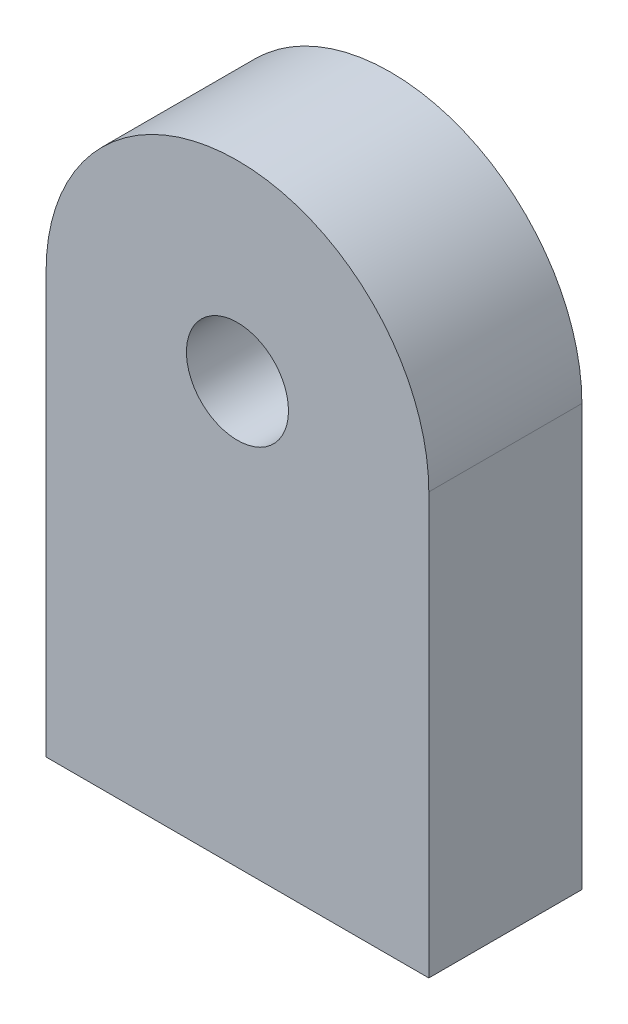
ISO-10303-21;
HEADER;
FILE_DESCRIPTION(('STEP AP214'),'2;1');
FILE_NAME('part.step','',(''),(''),'','','');
FILE_SCHEMA(('AUTOMOTIVE_DESIGN { 1 0 10303 214 1 1 1 1 }'));
ENDSEC;
DATA;
#1=APPLICATION_CONTEXT('core data for automotive mechanical design processes');
#2=APPLICATION_PROTOCOL_DEFINITION('international standard','automotive_design',2000,#1);
#3=PRODUCT_CONTEXT('',#1,'mechanical');
#4=PRODUCT('Part','Part','',(#3));
#5=PRODUCT_RELATED_PRODUCT_CATEGORY('part','',(#4));
#6=PRODUCT_DEFINITION_FORMATION('','',#4);
#7=PRODUCT_DEFINITION_CONTEXT('part definition',#1,'design');
#8=PRODUCT_DEFINITION('design','',#6,#7);
#9=PRODUCT_DEFINITION_SHAPE('','',#8);
#10=(LENGTH_UNIT() NAMED_UNIT(*) SI_UNIT(.MILLI.,.METRE.));
#11=(NAMED_UNIT(*) PLANE_ANGLE_UNIT() SI_UNIT($,.RADIAN.));
#12=(NAMED_UNIT(*) SI_UNIT($,.STERADIAN.) SOLID_ANGLE_UNIT());
#13=UNCERTAINTY_MEASURE_WITH_UNIT(LENGTH_MEASURE(1.E-05),#10,'distance_accuracy_value','');
#14=(GEOMETRIC_REPRESENTATION_CONTEXT(3) GLOBAL_UNCERTAINTY_ASSIGNED_CONTEXT((#13)) GLOBAL_UNIT_ASSIGNED_CONTEXT((#10,
#11,#12)) REPRESENTATION_CONTEXT('',''));
#15=CARTESIAN_POINT('',(0.,0.,0.));
#16=DIRECTION('',(0.,0.,1.));
#17=DIRECTION('',(1.,0.,0.));
#18=AXIS2_PLACEMENT_3D('',#15,#16,#17);
#19=CARTESIAN_POINT('',(0.,0.,0.));
#20=DIRECTION('',(0.,0.,1.));
#21=DIRECTION('',(1.,0.,0.));
#22=AXIS2_PLACEMENT_3D('',#19,#20,#21);
#23=PLANE('',#22);
#24=CARTESIAN_POINT('',(0.,0.,0.));
#25=DIRECTION('',(0.,0.,1.));
#26=DIRECTION('',(1.,0.,0.));
#27=AXIS2_PLACEMENT_3D('',#24,#25,#26);
#28=CIRCLE('',#27,15.);
#29=CARTESIAN_POINT('',(15.,0.,0.));
#30=VERTEX_POINT('',#29);
#31=CARTESIAN_POINT('',(-15.,0.,0.));
#32=VERTEX_POINT('',#31);
#33=EDGE_CURVE('E11',#30,#32,#28,.T.);
#34=ORIENTED_EDGE('',*,*,#33,.F.);
#35=DIRECTION('',(0.,1.,0.));
#36=VECTOR('',#35,1.);
#37=CARTESIAN_POINT('',(15.,0.,0.));
#38=LINE('',#37,#36);
#39=CARTESIAN_POINT('',(15.,-33.,0.));
#40=VERTEX_POINT('',#39);
#41=EDGE_CURVE('E65',#40,#30,#38,.T.);
#42=ORIENTED_EDGE('',*,*,#41,.F.);
#43=DIRECTION('',(1.,0.,0.));
#44=VECTOR('',#43,1.);
#45=CARTESIAN_POINT('',(15.,-33.,0.));
#46=LINE('',#45,#44);
#47=CARTESIAN_POINT('',(-15.,-33.,0.));
#48=VERTEX_POINT('',#47);
#49=EDGE_CURVE('E94',#48,#40,#46,.T.);
#50=ORIENTED_EDGE('',*,*,#49,.F.);
#51=DIRECTION('',(0.,-1.,0.));
#52=VECTOR('',#51,1.);
#53=CARTESIAN_POINT('',(-15.,0.,0.));
#54=LINE('',#53,#52);
#55=EDGE_CURVE('E102',#32,#48,#54,.T.);
#56=ORIENTED_EDGE('',*,*,#55,.F.);
#57=EDGE_LOOP('',(#34,#42,#50,#56));
#58=FACE_BOUND('',#57,.T.);
#59=CARTESIAN_POINT('',(0.,0.,0.));
#60=DIRECTION('',(0.,0.,1.));
#61=DIRECTION('',(1.,0.,0.));
#62=AXIS2_PLACEMENT_3D('',#59,#60,#61);
#63=CIRCLE('',#62,11.);
#64=CARTESIAN_POINT('',(11.,0.,0.));
#65=VERTEX_POINT('',#64);
#66=EDGE_CURVE('E50',#65,#65,#63,.T.);
#67=ORIENTED_EDGE('',*,*,#66,.T.);
#68=EDGE_LOOP('',(#67));
#69=FACE_BOUND('',#68,.T.);
#70=ADVANCED_FACE('F41',(#58,#69),#23,.F.);
#71=CARTESIAN_POINT('',(0.,0.,4.));
#72=DIRECTION('',(0.,0.,-1.));
#73=DIRECTION('',(-1.,0.,0.));
#74=AXIS2_PLACEMENT_3D('',#71,#72,#73);
#75=CYLINDRICAL_SURFACE('',#74,15.);
#76=CARTESIAN_POINT('',(0.,0.,12.));
#77=DIRECTION('',(0.,0.,1.));
#78=DIRECTION('',(1.,0.,0.));
#79=AXIS2_PLACEMENT_3D('',#76,#77,#78);
#80=CIRCLE('',#79,15.);
#81=CARTESIAN_POINT('',(15.,0.,12.));
#82=VERTEX_POINT('',#81);
#83=CARTESIAN_POINT('',(-15.,0.,12.));
#84=VERTEX_POINT('',#83);
#85=EDGE_CURVE('E134',#82,#84,#80,.T.);
#86=ORIENTED_EDGE('',*,*,#85,.F.);
#87=DIRECTION('',(0.,0.,1.));
#88=VECTOR('',#87,1.);
#89=CARTESIAN_POINT('',(15.,0.,0.));
#90=LINE('',#89,#88);
#91=EDGE_CURVE('E122',#30,#82,#90,.T.);
#92=ORIENTED_EDGE('',*,*,#91,.F.);
#93=ORIENTED_EDGE('',*,*,#33,.T.);
#94=DIRECTION('',(0.,0.,1.));
#95=VECTOR('',#94,1.);
#96=CARTESIAN_POINT('',(-15.,0.,0.));
#97=LINE('',#96,#95);
#98=EDGE_CURVE('E88',#32,#84,#97,.T.);
#99=ORIENTED_EDGE('',*,*,#98,.T.);
#100=EDGE_LOOP('',(#86,#92,#93,#99));
#101=FACE_BOUND('',#100,.T.);
#102=ADVANCED_FACE('F43',(#101),#75,.T.);
#103=CARTESIAN_POINT('',(0.,0.,4.));
#104=DIRECTION('',(0.,0.,-1.));
#105=DIRECTION('',(-1.,0.,0.));
#106=AXIS2_PLACEMENT_3D('',#103,#104,#105);
#107=CYLINDRICAL_SURFACE('',#106,11.);
#108=CARTESIAN_POINT('',(0.,0.,4.));
#109=DIRECTION('',(0.,0.,1.));
#110=DIRECTION('',(1.,0.,0.));
#111=AXIS2_PLACEMENT_3D('',#108,#109,#110);
#112=CIRCLE('',#111,11.);
#113=CARTESIAN_POINT('',(11.,0.,4.));
#114=VERTEX_POINT('',#113);
#115=EDGE_CURVE('E140',#114,#114,#112,.T.);
#116=ORIENTED_EDGE('',*,*,#115,.T.);
#117=EDGE_LOOP('',(#116));
#118=FACE_BOUND('',#117,.T.);
#119=ORIENTED_EDGE('',*,*,#66,.F.);
#120=EDGE_LOOP('',(#119));
#121=FACE_BOUND('',#120,.T.);
#122=ADVANCED_FACE('F147',(#118,#121),#107,.F.);
#123=CARTESIAN_POINT('',(0.,0.,4.));
#124=DIRECTION('',(0.,0.,1.));
#125=DIRECTION('',(1.,0.,0.));
#126=AXIS2_PLACEMENT_3D('',#123,#124,#125);
#127=PLANE('',#126);
#128=CARTESIAN_POINT('',(0.,0.,4.));
#129=DIRECTION('',(0.,0.,1.));
#130=DIRECTION('',(1.,0.,0.));
#131=AXIS2_PLACEMENT_3D('',#128,#129,#130);
#132=CIRCLE('',#131,4.);
#133=CARTESIAN_POINT('',(4.,0.,4.));
#134=VERTEX_POINT('',#133);
#135=EDGE_CURVE('E125',#134,#134,#132,.T.);
#136=ORIENTED_EDGE('',*,*,#135,.T.);
#137=EDGE_LOOP('',(#136));
#138=FACE_BOUND('',#137,.T.);
#139=ORIENTED_EDGE('',*,*,#115,.F.);
#140=EDGE_LOOP('',(#139));
#141=FACE_BOUND('',#140,.T.);
#142=ADVANCED_FACE('F149',(#138,#141),#127,.F.);
#143=CARTESIAN_POINT('',(0.,0.,12.));
#144=DIRECTION('',(0.,0.,1.));
#145=DIRECTION('',(1.,0.,0.));
#146=AXIS2_PLACEMENT_3D('',#143,#144,#145);
#147=PLANE('',#146);
#148=ORIENTED_EDGE('',*,*,#85,.T.);
#149=DIRECTION('',(0.,-1.,0.));
#150=VECTOR('',#149,1.);
#151=CARTESIAN_POINT('',(-15.,0.,12.));
#152=LINE('',#151,#150);
#153=CARTESIAN_POINT('',(-15.,-33.,12.));
#154=VERTEX_POINT('',#153);
#155=EDGE_CURVE('E116',#84,#154,#152,.T.);
#156=ORIENTED_EDGE('',*,*,#155,.T.);
#157=DIRECTION('',(1.,0.,0.));
#158=VECTOR('',#157,1.);
#159=CARTESIAN_POINT('',(15.,-33.,12.));
#160=LINE('',#159,#158);
#161=CARTESIAN_POINT('',(15.,-33.,12.));
#162=VERTEX_POINT('',#161);
#163=EDGE_CURVE('E95',#154,#162,#160,.T.);
#164=ORIENTED_EDGE('',*,*,#163,.T.);
#165=DIRECTION('',(0.,1.,0.));
#166=VECTOR('',#165,1.);
#167=CARTESIAN_POINT('',(15.,0.,12.));
#168=LINE('',#167,#166);
#169=EDGE_CURVE('E57',#162,#82,#168,.T.);
#170=ORIENTED_EDGE('',*,*,#169,.T.);
#171=EDGE_LOOP('',(#148,#156,#164,#170));
#172=FACE_BOUND('',#171,.T.);
#173=CARTESIAN_POINT('',(0.,0.,12.));
#174=DIRECTION('',(0.,0.,1.));
#175=DIRECTION('',(1.,0.,0.));
#176=AXIS2_PLACEMENT_3D('',#173,#174,#175);
#177=CIRCLE('',#176,4.);
#178=CARTESIAN_POINT('',(4.,0.,12.));
#179=VERTEX_POINT('',#178);
#180=EDGE_CURVE('E130',#179,#179,#177,.T.);
#181=ORIENTED_EDGE('',*,*,#180,.F.);
#182=EDGE_LOOP('',(#181));
#183=FACE_BOUND('',#182,.T.);
#184=ADVANCED_FACE('F156',(#172,#183),#147,.T.);
#185=CARTESIAN_POINT('',(0.,0.,12.));
#186=DIRECTION('',(0.,0.,-1.));
#187=DIRECTION('',(-1.,0.,0.));
#188=AXIS2_PLACEMENT_3D('',#185,#186,#187);
#189=CYLINDRICAL_SURFACE('',#188,4.);
#190=ORIENTED_EDGE('',*,*,#180,.T.);
#191=EDGE_LOOP('',(#190));
#192=FACE_BOUND('',#191,.T.);
#193=ORIENTED_EDGE('',*,*,#135,.F.);
#194=EDGE_LOOP('',(#193));
#195=FACE_BOUND('',#194,.T.);
#196=ADVANCED_FACE('F180',(#192,#195),#189,.F.);
#197=CARTESIAN_POINT('',(15.,0.,0.));
#198=DIRECTION('',(1.,0.,0.));
#199=DIRECTION('',(0.,1.,0.));
#200=AXIS2_PLACEMENT_3D('',#197,#198,#199);
#201=PLANE('',#200);
#202=ORIENTED_EDGE('',*,*,#169,.F.);
#203=DIRECTION('',(0.,0.,1.));
#204=VECTOR('',#203,1.);
#205=CARTESIAN_POINT('',(15.,-33.,0.));
#206=LINE('',#205,#204);
#207=EDGE_CURVE('E82',#40,#162,#206,.T.);
#208=ORIENTED_EDGE('',*,*,#207,.F.);
#209=ORIENTED_EDGE('',*,*,#41,.T.);
#210=ORIENTED_EDGE('',*,*,#91,.T.);
#211=EDGE_LOOP('',(#202,#208,#209,#210));
#212=FACE_BOUND('',#211,.T.);
#213=ADVANCED_FACE('F188',(#212),#201,.T.);
#214=CARTESIAN_POINT('',(15.,-33.,0.));
#215=DIRECTION('',(0.,-1.,0.));
#216=DIRECTION('',(1.,0.,0.));
#217=AXIS2_PLACEMENT_3D('',#214,#215,#216);
#218=PLANE('',#217);
#219=CARTESIAN_POINT('',(7.,-33.,6.));
#220=DIRECTION('',(0.,-1.,0.));
#221=DIRECTION('',(1.,0.,0.));
#222=AXIS2_PLACEMENT_3D('',#219,#220,#221);
#223=CIRCLE('',#222,3.);
#224=CARTESIAN_POINT('',(10.,-33.,6.));
#225=VERTEX_POINT('',#224);
#226=EDGE_CURVE('E285',#225,#225,#223,.T.);
#227=ORIENTED_EDGE('',*,*,#226,.F.);
#228=EDGE_LOOP('',(#227));
#229=FACE_BOUND('',#228,.T.);
#230=CARTESIAN_POINT('',(-6.99999999999999,-33.,6.));
#231=DIRECTION('',(0.,-1.,0.));
#232=DIRECTION('',(1.,0.,0.));
#233=AXIS2_PLACEMENT_3D('',#230,#231,#232);
#234=CIRCLE('',#233,3.);
#235=CARTESIAN_POINT('',(-3.99999999999999,-33.,6.));
#236=VERTEX_POINT('',#235);
#237=EDGE_CURVE('E111',#236,#236,#234,.T.);
#238=ORIENTED_EDGE('',*,*,#237,.F.);
#239=EDGE_LOOP('',(#238));
#240=FACE_BOUND('',#239,.T.);
#241=ORIENTED_EDGE('',*,*,#163,.F.);
#242=DIRECTION('',(0.,0.,1.));
#243=VECTOR('',#242,1.);
#244=CARTESIAN_POINT('',(-15.,-33.,0.));
#245=LINE('',#244,#243);
#246=EDGE_CURVE('E91',#48,#154,#245,.T.);
#247=ORIENTED_EDGE('',*,*,#246,.F.);
#248=ORIENTED_EDGE('',*,*,#49,.T.);
#249=ORIENTED_EDGE('',*,*,#207,.T.);
#250=EDGE_LOOP('',(#241,#247,#248,#249));
#251=FACE_BOUND('',#250,.T.);
#252=ADVANCED_FACE('F93',(#229,#240,#251),#218,.T.);
#253=CARTESIAN_POINT('',(-15.,0.,0.));
#254=DIRECTION('',(-1.,0.,0.));
#255=DIRECTION('',(0.,-1.,0.));
#256=AXIS2_PLACEMENT_3D('',#253,#254,#255);
#257=PLANE('',#256);
#258=ORIENTED_EDGE('',*,*,#155,.F.);
#259=ORIENTED_EDGE('',*,*,#98,.F.);
#260=ORIENTED_EDGE('',*,*,#55,.T.);
#261=ORIENTED_EDGE('',*,*,#246,.T.);
#262=EDGE_LOOP('',(#258,#259,#260,#261));
#263=FACE_BOUND('',#262,.T.);
#264=ADVANCED_FACE('F105',(#263),#257,.T.);
#265=CARTESIAN_POINT('',(-7.,-19.,6.));
#266=DIRECTION('',(0.,-1.,0.));
#267=DIRECTION('',(1.,0.,0.));
#268=AXIS2_PLACEMENT_3D('',#265,#266,#267);
#269=CYLINDRICAL_SURFACE('',#268,3.);
#270=CARTESIAN_POINT('',(-7.,-19.,6.));
#271=DIRECTION('',(0.,-1.,0.));
#272=DIRECTION('',(1.,0.,0.));
#273=AXIS2_PLACEMENT_3D('',#270,#271,#272);
#274=CIRCLE('',#273,3.);
#275=CARTESIAN_POINT('',(-4.,-19.,6.));
#276=VERTEX_POINT('',#275);
#277=EDGE_CURVE('E289',#276,#276,#274,.T.);
#278=ORIENTED_EDGE('',*,*,#277,.F.);
#279=EDGE_LOOP('',(#278));
#280=FACE_BOUND('',#279,.T.);
#281=ORIENTED_EDGE('',*,*,#237,.T.);
#282=EDGE_LOOP('',(#281));
#283=FACE_BOUND('',#282,.T.);
#284=ADVANCED_FACE('F202',(#280,#283),#269,.F.);
#285=CARTESIAN_POINT('',(-7.,-19.,6.));
#286=DIRECTION('',(0.,-1.,0.));
#287=DIRECTION('',(1.,0.,0.));
#288=AXIS2_PLACEMENT_3D('',#285,#286,#287);
#289=PLANE('',#288);
#290=ORIENTED_EDGE('',*,*,#277,.T.);
#291=EDGE_LOOP('',(#290));
#292=FACE_BOUND('',#291,.T.);
#293=ADVANCED_FACE('F218',(#292),#289,.T.);
#294=CARTESIAN_POINT('',(7.,-19.,6.));
#295=DIRECTION('',(0.,-1.,0.));
#296=DIRECTION('',(1.,0.,0.));
#297=AXIS2_PLACEMENT_3D('',#294,#295,#296);
#298=CYLINDRICAL_SURFACE('',#297,3.);
#299=CARTESIAN_POINT('',(7.,-19.,6.));
#300=DIRECTION('',(0.,-1.,0.));
#301=DIRECTION('',(1.,0.,0.));
#302=AXIS2_PLACEMENT_3D('',#299,#300,#301);
#303=CIRCLE('',#302,3.);
#304=CARTESIAN_POINT('',(10.,-19.,6.));
#305=VERTEX_POINT('',#304);
#306=EDGE_CURVE('E119',#305,#305,#303,.T.);
#307=ORIENTED_EDGE('',*,*,#306,.F.);
#308=EDGE_LOOP('',(#307));
#309=FACE_BOUND('',#308,.T.);
#310=ORIENTED_EDGE('',*,*,#226,.T.);
#311=EDGE_LOOP('',(#310));
#312=FACE_BOUND('',#311,.T.);
#313=ADVANCED_FACE('F228',(#309,#312),#298,.F.);
#314=CARTESIAN_POINT('',(7.,-19.,6.));
#315=DIRECTION('',(0.,-1.,0.));
#316=DIRECTION('',(1.,0.,0.));
#317=AXIS2_PLACEMENT_3D('',#314,#315,#316);
#318=PLANE('',#317);
#319=ORIENTED_EDGE('',*,*,#306,.T.);
#320=EDGE_LOOP('',(#319));
#321=FACE_BOUND('',#320,.T.);
#322=ADVANCED_FACE('F238',(#321),#318,.T.);
#323=CLOSED_SHELL('',(#70,#102,#122,#142,#184,#196,#213,#252,#264,#284,#293,#313,#322));
#324=MANIFOLD_SOLID_BREP('B2',#323);
#325=ADVANCED_BREP_SHAPE_REPRESENTATION('',(#18,#324),#14);
#326=SHAPE_DEFINITION_REPRESENTATION(#9,#325);
ENDSEC;
END-ISO-10303-21;
